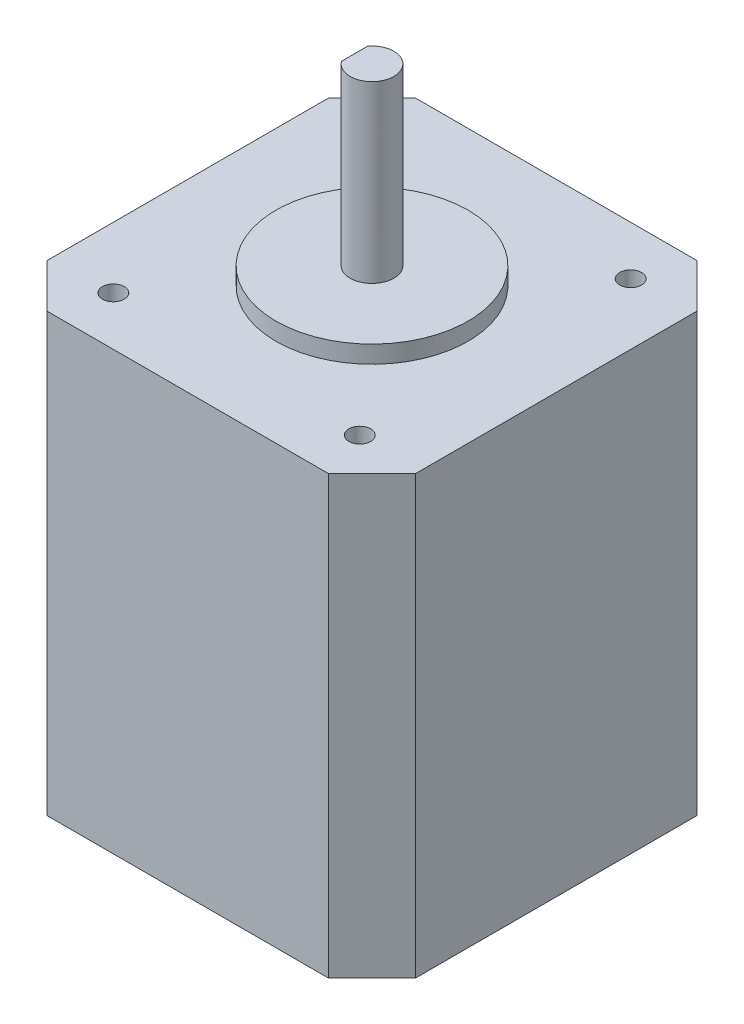
ISO-10303-21;
HEADER;
FILE_DESCRIPTION(('STEP AP214'),'2;1');
FILE_NAME('part.step','',(''),(''),'','','');
FILE_SCHEMA(('AUTOMOTIVE_DESIGN { 1 0 10303 214 1 1 1 1 }'));
ENDSEC;
DATA;
#1=APPLICATION_CONTEXT('core data for automotive mechanical design processes');
#2=APPLICATION_PROTOCOL_DEFINITION('international standard','automotive_design',2000,#1);
#3=PRODUCT_CONTEXT('',#1,'mechanical');
#4=PRODUCT('Part','Part','',(#3));
#5=PRODUCT_RELATED_PRODUCT_CATEGORY('part','',(#4));
#6=PRODUCT_DEFINITION_FORMATION('','',#4);
#7=PRODUCT_DEFINITION_CONTEXT('part definition',#1,'design');
#8=PRODUCT_DEFINITION('design','',#6,#7);
#9=PRODUCT_DEFINITION_SHAPE('','',#8);
#10=(LENGTH_UNIT() NAMED_UNIT(*) SI_UNIT(.MILLI.,.METRE.));
#11=(NAMED_UNIT(*) PLANE_ANGLE_UNIT() SI_UNIT($,.RADIAN.));
#12=(NAMED_UNIT(*) SI_UNIT($,.STERADIAN.) SOLID_ANGLE_UNIT());
#13=UNCERTAINTY_MEASURE_WITH_UNIT(LENGTH_MEASURE(1.E-05),#10,'distance_accuracy_value','');
#14=(GEOMETRIC_REPRESENTATION_CONTEXT(3) GLOBAL_UNCERTAINTY_ASSIGNED_CONTEXT((#13)) GLOBAL_UNIT_ASSIGNED_CONTEXT((#10,
#11,#12)) REPRESENTATION_CONTEXT('',''));
#15=CARTESIAN_POINT('',(0.,0.,0.));
#16=DIRECTION('',(0.,0.,1.));
#17=DIRECTION('',(1.,0.,0.));
#18=AXIS2_PLACEMENT_3D('',#15,#16,#17);
#19=CARTESIAN_POINT('',(0.,50.,-21.1));
#20=DIRECTION('',(0.,0.,-1.));
#21=DIRECTION('',(-1.,0.,0.));
#22=AXIS2_PLACEMENT_3D('',#19,#20,#21);
#23=PLANE('',#22);
#24=DIRECTION('',(-1.,0.,0.));
#25=VECTOR('',#24,1.);
#26=CARTESIAN_POINT('',(0.,9.,-21.1));
#27=LINE('',#26,#25);
#28=CARTESIAN_POINT('',(10.,9.,-21.1));
#29=VERTEX_POINT('',#28);
#30=CARTESIAN_POINT('',(-10.,9.,-21.1));
#31=VERTEX_POINT('',#30);
#32=EDGE_CURVE('E167',#29,#31,#27,.T.);
#33=ORIENTED_EDGE('',*,*,#32,.T.);
#34=DIRECTION('',(0.,-1.,0.));
#35=VECTOR('',#34,1.);
#36=CARTESIAN_POINT('',(-10.,0.,-21.1));
#37=LINE('',#36,#35);
#38=CARTESIAN_POINT('',(-10.,0.,-21.1));
#39=VERTEX_POINT('',#38);
#40=EDGE_CURVE('E54',#31,#39,#37,.T.);
#41=ORIENTED_EDGE('',*,*,#40,.T.);
#42=DIRECTION('',(1.,0.,0.));
#43=VECTOR('',#42,1.);
#44=CARTESIAN_POINT('',(0.,0.,-21.1));
#45=LINE('',#44,#43);
#46=CARTESIAN_POINT('',(-16.1,0.,-21.1));
#47=VERTEX_POINT('',#46);
#48=EDGE_CURVE('E260',#47,#39,#45,.T.);
#49=ORIENTED_EDGE('',*,*,#48,.F.);
#50=DIRECTION('',(0.,-1.,0.));
#51=VECTOR('',#50,1.);
#52=CARTESIAN_POINT('',(-16.1,50.,-21.1));
#53=LINE('',#52,#51);
#54=CARTESIAN_POINT('',(-16.1,50.,-21.1));
#55=VERTEX_POINT('',#54);
#56=EDGE_CURVE('E269',#55,#47,#53,.T.);
#57=ORIENTED_EDGE('',*,*,#56,.F.);
#58=DIRECTION('',(1.,0.,0.));
#59=VECTOR('',#58,1.);
#60=CARTESIAN_POINT('',(0.,50.,-21.1));
#61=LINE('',#60,#59);
#62=CARTESIAN_POINT('',(16.1,50.,-21.1));
#63=VERTEX_POINT('',#62);
#64=EDGE_CURVE('E224',#55,#63,#61,.T.);
#65=ORIENTED_EDGE('',*,*,#64,.T.);
#66=DIRECTION('',(0.,-1.,0.));
#67=VECTOR('',#66,1.);
#68=CARTESIAN_POINT('',(16.1,50.,-21.1));
#69=LINE('',#68,#67);
#70=CARTESIAN_POINT('',(16.1,0.,-21.1));
#71=VERTEX_POINT('',#70);
#72=EDGE_CURVE('E271',#63,#71,#69,.T.);
#73=ORIENTED_EDGE('',*,*,#72,.T.);
#74=CARTESIAN_POINT('',(10.,0.,-21.1));
#75=VERTEX_POINT('',#74);
#76=EDGE_CURVE('E259',#75,#71,#45,.T.);
#77=ORIENTED_EDGE('',*,*,#76,.F.);
#78=DIRECTION('',(0.,-1.,0.));
#79=VECTOR('',#78,1.);
#80=CARTESIAN_POINT('',(10.,0.,-21.1));
#81=LINE('',#80,#79);
#82=EDGE_CURVE('E156',#29,#75,#81,.T.);
#83=ORIENTED_EDGE('',*,*,#82,.F.);
#84=EDGE_LOOP('',(#33,#41,#49,#57,#65,#73,#77,#83));
#85=FACE_BOUND('',#84,.T.);
#86=ADVANCED_FACE('F39',(#85),#23,.T.);
#87=CARTESIAN_POINT('',(-21.1,50.,0.));
#88=DIRECTION('',(1.,0.,0.));
#89=DIRECTION('',(0.,0.,-1.));
#90=AXIS2_PLACEMENT_3D('',#87,#88,#89);
#91=PLANE('',#90);
#92=DIRECTION('',(0.,0.,1.));
#93=VECTOR('',#92,1.);
#94=CARTESIAN_POINT('',(-21.1,0.,0.));
#95=LINE('',#94,#93);
#96=CARTESIAN_POINT('',(-21.1,0.,-16.1));
#97=VERTEX_POINT('',#96);
#98=CARTESIAN_POINT('',(-21.1,0.,16.1));
#99=VERTEX_POINT('',#98);
#100=EDGE_CURVE('E242',#97,#99,#95,.T.);
#101=ORIENTED_EDGE('',*,*,#100,.T.);
#102=DIRECTION('',(0.,-1.,0.));
#103=VECTOR('',#102,1.);
#104=CARTESIAN_POINT('',(-21.1,50.,16.1));
#105=LINE('',#104,#103);
#106=CARTESIAN_POINT('',(-21.1,50.,16.1));
#107=VERTEX_POINT('',#106);
#108=EDGE_CURVE('E11',#107,#99,#105,.T.);
#109=ORIENTED_EDGE('',*,*,#108,.F.);
#110=DIRECTION('',(0.,0.,1.));
#111=VECTOR('',#110,1.);
#112=CARTESIAN_POINT('',(-21.1,50.,0.));
#113=LINE('',#112,#111);
#114=CARTESIAN_POINT('',(-21.1,50.,-16.1));
#115=VERTEX_POINT('',#114);
#116=EDGE_CURVE('E208',#115,#107,#113,.T.);
#117=ORIENTED_EDGE('',*,*,#116,.F.);
#118=DIRECTION('',(0.,-1.,0.));
#119=VECTOR('',#118,1.);
#120=CARTESIAN_POINT('',(-21.1,50.,-16.1));
#121=LINE('',#120,#119);
#122=EDGE_CURVE('E233',#115,#97,#121,.T.);
#123=ORIENTED_EDGE('',*,*,#122,.T.);
#124=EDGE_LOOP('',(#101,#109,#117,#123));
#125=FACE_BOUND('',#124,.T.);
#126=ADVANCED_FACE('F317',(#125),#91,.F.);
#127=CARTESIAN_POINT('',(-18.6,50.,18.6));
#128=DIRECTION('',(0.707106781186548,0.,-0.707106781186548));
#129=DIRECTION('',(-0.707106781186548,0.,-0.707106781186548));
#130=AXIS2_PLACEMENT_3D('',#127,#128,#129);
#131=PLANE('',#130);
#132=DIRECTION('',(0.707106781186548,0.,0.707106781186548));
#133=VECTOR('',#132,1.);
#134=CARTESIAN_POINT('',(-18.6,0.,18.6));
#135=LINE('',#134,#133);
#136=CARTESIAN_POINT('',(-16.1,0.,21.1));
#137=VERTEX_POINT('',#136);
#138=EDGE_CURVE('E245',#99,#137,#135,.T.);
#139=ORIENTED_EDGE('',*,*,#138,.T.);
#140=DIRECTION('',(0.,-1.,0.));
#141=VECTOR('',#140,1.);
#142=CARTESIAN_POINT('',(-16.1,50.,21.1));
#143=LINE('',#142,#141);
#144=CARTESIAN_POINT('',(-16.1,50.,21.1));
#145=VERTEX_POINT('',#144);
#146=EDGE_CURVE('E47',#145,#137,#143,.T.);
#147=ORIENTED_EDGE('',*,*,#146,.F.);
#148=DIRECTION('',(0.707106781186548,0.,0.707106781186548));
#149=VECTOR('',#148,1.);
#150=CARTESIAN_POINT('',(-18.6,50.,18.6));
#151=LINE('',#150,#149);
#152=EDGE_CURVE('E211',#107,#145,#151,.T.);
#153=ORIENTED_EDGE('',*,*,#152,.F.);
#154=ORIENTED_EDGE('',*,*,#108,.T.);
#155=EDGE_LOOP('',(#139,#147,#153,#154));
#156=FACE_BOUND('',#155,.T.);
#157=ADVANCED_FACE('F318',(#156),#131,.F.);
#158=CARTESIAN_POINT('',(0.,50.,21.1));
#159=DIRECTION('',(0.,0.,-1.));
#160=DIRECTION('',(-1.,0.,0.));
#161=AXIS2_PLACEMENT_3D('',#158,#159,#160);
#162=PLANE('',#161);
#163=DIRECTION('',(1.,0.,0.));
#164=VECTOR('',#163,1.);
#165=CARTESIAN_POINT('',(0.,0.,21.1));
#166=LINE('',#165,#164);
#167=CARTESIAN_POINT('',(16.1,0.,21.1));
#168=VERTEX_POINT('',#167);
#169=EDGE_CURVE('E247',#137,#168,#166,.T.);
#170=ORIENTED_EDGE('',*,*,#169,.T.);
#171=DIRECTION('',(0.,-1.,0.));
#172=VECTOR('',#171,1.);
#173=CARTESIAN_POINT('',(16.1,50.,21.1));
#174=LINE('',#173,#172);
#175=CARTESIAN_POINT('',(16.1,50.,21.1));
#176=VERTEX_POINT('',#175);
#177=EDGE_CURVE('E278',#176,#168,#174,.T.);
#178=ORIENTED_EDGE('',*,*,#177,.F.);
#179=DIRECTION('',(1.,0.,0.));
#180=VECTOR('',#179,1.);
#181=CARTESIAN_POINT('',(0.,50.,21.1));
#182=LINE('',#181,#180);
#183=EDGE_CURVE('E213',#145,#176,#182,.T.);
#184=ORIENTED_EDGE('',*,*,#183,.F.);
#185=ORIENTED_EDGE('',*,*,#146,.T.);
#186=EDGE_LOOP('',(#170,#178,#184,#185));
#187=FACE_BOUND('',#186,.T.);
#188=ADVANCED_FACE('F284',(#187),#162,.F.);
#189=CARTESIAN_POINT('',(18.6,50.,18.6));
#190=DIRECTION('',(0.707106781186548,0.,0.707106781186548));
#191=DIRECTION('',(0.707106781186548,0.,-0.707106781186548));
#192=AXIS2_PLACEMENT_3D('',#189,#190,#191);
#193=PLANE('',#192);
#194=DIRECTION('',(-0.707106781186548,0.,0.707106781186548));
#195=VECTOR('',#194,1.);
#196=CARTESIAN_POINT('',(18.6,0.,18.6));
#197=LINE('',#196,#195);
#198=CARTESIAN_POINT('',(21.1,0.,16.1));
#199=VERTEX_POINT('',#198);
#200=EDGE_CURVE('E250',#199,#168,#197,.T.);
#201=ORIENTED_EDGE('',*,*,#200,.F.);
#202=DIRECTION('',(0.,-1.,0.));
#203=VECTOR('',#202,1.);
#204=CARTESIAN_POINT('',(21.1,50.,16.1));
#205=LINE('',#204,#203);
#206=CARTESIAN_POINT('',(21.1,50.,16.1));
#207=VERTEX_POINT('',#206);
#208=EDGE_CURVE('E276',#207,#199,#205,.T.);
#209=ORIENTED_EDGE('',*,*,#208,.F.);
#210=DIRECTION('',(-0.707106781186548,0.,0.707106781186548));
#211=VECTOR('',#210,1.);
#212=CARTESIAN_POINT('',(18.6,50.,18.6));
#213=LINE('',#212,#211);
#214=EDGE_CURVE('E215',#207,#176,#213,.T.);
#215=ORIENTED_EDGE('',*,*,#214,.T.);
#216=ORIENTED_EDGE('',*,*,#177,.T.);
#217=EDGE_LOOP('',(#201,#209,#215,#216));
#218=FACE_BOUND('',#217,.T.);
#219=ADVANCED_FACE('F294',(#218),#193,.T.);
#220=CARTESIAN_POINT('',(21.1,50.,0.));
#221=DIRECTION('',(1.,0.,0.));
#222=DIRECTION('',(0.,0.,-1.));
#223=AXIS2_PLACEMENT_3D('',#220,#221,#222);
#224=PLANE('',#223);
#225=DIRECTION('',(0.,0.,1.));
#226=VECTOR('',#225,1.);
#227=CARTESIAN_POINT('',(21.1,0.,0.));
#228=LINE('',#227,#226);
#229=CARTESIAN_POINT('',(21.1,0.,-16.1));
#230=VERTEX_POINT('',#229);
#231=EDGE_CURVE('E253',#230,#199,#228,.T.);
#232=ORIENTED_EDGE('',*,*,#231,.F.);
#233=DIRECTION('',(0.,-1.,0.));
#234=VECTOR('',#233,1.);
#235=CARTESIAN_POINT('',(21.1,50.,-16.1));
#236=LINE('',#235,#234);
#237=CARTESIAN_POINT('',(21.1,50.,-16.1));
#238=VERTEX_POINT('',#237);
#239=EDGE_CURVE('E274',#238,#230,#236,.T.);
#240=ORIENTED_EDGE('',*,*,#239,.F.);
#241=DIRECTION('',(0.,0.,1.));
#242=VECTOR('',#241,1.);
#243=CARTESIAN_POINT('',(21.1,50.,0.));
#244=LINE('',#243,#242);
#245=EDGE_CURVE('E218',#238,#207,#244,.T.);
#246=ORIENTED_EDGE('',*,*,#245,.T.);
#247=ORIENTED_EDGE('',*,*,#208,.T.);
#248=EDGE_LOOP('',(#232,#240,#246,#247));
#249=FACE_BOUND('',#248,.T.);
#250=ADVANCED_FACE('F302',(#249),#224,.T.);
#251=CARTESIAN_POINT('',(18.6,50.,-18.6));
#252=DIRECTION('',(0.707106781186548,0.,-0.707106781186548));
#253=DIRECTION('',(-0.707106781186548,0.,-0.707106781186548));
#254=AXIS2_PLACEMENT_3D('',#251,#252,#253);
#255=PLANE('',#254);
#256=DIRECTION('',(0.707106781186548,0.,0.707106781186548));
#257=VECTOR('',#256,1.);
#258=CARTESIAN_POINT('',(18.6,0.,-18.6));
#259=LINE('',#258,#257);
#260=EDGE_CURVE('E256',#71,#230,#259,.T.);
#261=ORIENTED_EDGE('',*,*,#260,.F.);
#262=ORIENTED_EDGE('',*,*,#72,.F.);
#263=DIRECTION('',(0.707106781186548,0.,0.707106781186548));
#264=VECTOR('',#263,1.);
#265=CARTESIAN_POINT('',(18.6,50.,-18.6));
#266=LINE('',#265,#264);
#267=EDGE_CURVE('E221',#63,#238,#266,.T.);
#268=ORIENTED_EDGE('',*,*,#267,.T.);
#269=ORIENTED_EDGE('',*,*,#239,.T.);
#270=EDGE_LOOP('',(#261,#262,#268,#269));
#271=FACE_BOUND('',#270,.T.);
#272=ADVANCED_FACE('F305',(#271),#255,.T.);
#273=CARTESIAN_POINT('',(-18.6,50.,-18.6));
#274=DIRECTION('',(-0.707106781186548,0.,-0.707106781186548));
#275=DIRECTION('',(-0.707106781186548,0.,0.707106781186548));
#276=AXIS2_PLACEMENT_3D('',#273,#274,#275);
#277=PLANE('',#276);
#278=DIRECTION('',(0.707106781186548,0.,-0.707106781186548));
#279=VECTOR('',#278,1.);
#280=CARTESIAN_POINT('',(-18.6,0.,-18.6));
#281=LINE('',#280,#279);
#282=EDGE_CURVE('E263',#97,#47,#281,.T.);
#283=ORIENTED_EDGE('',*,*,#282,.F.);
#284=ORIENTED_EDGE('',*,*,#122,.F.);
#285=DIRECTION('',(0.707106781186548,0.,-0.707106781186548));
#286=VECTOR('',#285,1.);
#287=CARTESIAN_POINT('',(-18.6,50.,-18.6));
#288=LINE('',#287,#286);
#289=EDGE_CURVE('E227',#115,#55,#288,.T.);
#290=ORIENTED_EDGE('',*,*,#289,.T.);
#291=ORIENTED_EDGE('',*,*,#56,.T.);
#292=EDGE_LOOP('',(#283,#284,#290,#291));
#293=FACE_BOUND('',#292,.T.);
#294=ADVANCED_FACE('F313',(#293),#277,.T.);
#295=CARTESIAN_POINT('',(-14.1,50.,-15.5));
#296=DIRECTION('',(0.,-1.,0.));
#297=DIRECTION('',(0.,0.,-1.));
#298=AXIS2_PLACEMENT_3D('',#295,#296,#297);
#299=CYLINDRICAL_SURFACE('',#298,1.25);
#300=CARTESIAN_POINT('',(-14.1,50.,-15.5));
#301=DIRECTION('',(0.,1.,0.));
#302=DIRECTION('',(0.,0.,1.));
#303=AXIS2_PLACEMENT_3D('',#300,#301,#302);
#304=CIRCLE('',#303,1.25);
#305=CARTESIAN_POINT('',(-14.1,50.,-14.25));
#306=VERTEX_POINT('',#305);
#307=EDGE_CURVE('E202',#306,#306,#304,.T.);
#308=ORIENTED_EDGE('',*,*,#307,.T.);
#309=EDGE_LOOP('',(#308));
#310=FACE_BOUND('',#309,.T.);
#311=CARTESIAN_POINT('',(-14.1,0.,-15.5));
#312=DIRECTION('',(0.,1.,0.));
#313=DIRECTION('',(0.,0.,1.));
#314=AXIS2_PLACEMENT_3D('',#311,#312,#313);
#315=CIRCLE('',#314,1.25);
#316=CARTESIAN_POINT('',(-14.1,0.,-14.25));
#317=VERTEX_POINT('',#316);
#318=EDGE_CURVE('E239',#317,#317,#315,.T.);
#319=ORIENTED_EDGE('',*,*,#318,.F.);
#320=EDGE_LOOP('',(#319));
#321=FACE_BOUND('',#320,.T.);
#322=ADVANCED_FACE('F357',(#310,#321),#299,.F.);
#323=CARTESIAN_POINT('',(14.1,50.,-15.5));
#324=DIRECTION('',(0.,-1.,0.));
#325=DIRECTION('',(0.,0.,-1.));
#326=AXIS2_PLACEMENT_3D('',#323,#324,#325);
#327=CYLINDRICAL_SURFACE('',#326,1.25);
#328=CARTESIAN_POINT('',(14.1,50.,-15.5));
#329=DIRECTION('',(0.,1.,0.));
#330=DIRECTION('',(0.,0.,1.));
#331=AXIS2_PLACEMENT_3D('',#328,#329,#330);
#332=CIRCLE('',#331,1.25);
#333=CARTESIAN_POINT('',(14.1,50.,-14.25));
#334=VERTEX_POINT('',#333);
#335=EDGE_CURVE('E198',#334,#334,#332,.T.);
#336=ORIENTED_EDGE('',*,*,#335,.T.);
#337=EDGE_LOOP('',(#336));
#338=FACE_BOUND('',#337,.T.);
#339=CARTESIAN_POINT('',(14.1,0.,-15.5));
#340=DIRECTION('',(0.,1.,0.));
#341=DIRECTION('',(0.,0.,1.));
#342=AXIS2_PLACEMENT_3D('',#339,#340,#341);
#343=CIRCLE('',#342,1.25);
#344=CARTESIAN_POINT('',(14.1,0.,-14.25));
#345=VERTEX_POINT('',#344);
#346=EDGE_CURVE('E236',#345,#345,#343,.T.);
#347=ORIENTED_EDGE('',*,*,#346,.F.);
#348=EDGE_LOOP('',(#347));
#349=FACE_BOUND('',#348,.T.);
#350=ADVANCED_FACE('F363',(#338,#349),#327,.F.);
#351=CARTESIAN_POINT('',(14.1,50.,15.5));
#352=DIRECTION('',(0.,-1.,0.));
#353=DIRECTION('',(0.,0.,-1.));
#354=AXIS2_PLACEMENT_3D('',#351,#352,#353);
#355=CYLINDRICAL_SURFACE('',#354,1.25);
#356=CARTESIAN_POINT('',(14.1,50.,15.5));
#357=DIRECTION('',(0.,1.,0.));
#358=DIRECTION('',(0.,0.,1.));
#359=AXIS2_PLACEMENT_3D('',#356,#357,#358);
#360=CIRCLE('',#359,1.25);
#361=CARTESIAN_POINT('',(14.1,50.,16.75));
#362=VERTEX_POINT('',#361);
#363=EDGE_CURVE('E195',#362,#362,#360,.F.);
#364=ORIENTED_EDGE('',*,*,#363,.F.);
#365=EDGE_LOOP('',(#364));
#366=FACE_BOUND('',#365,.T.);
#367=CARTESIAN_POINT('',(14.1,0.,15.5));
#368=DIRECTION('',(0.,1.,0.));
#369=DIRECTION('',(0.,0.,1.));
#370=AXIS2_PLACEMENT_3D('',#367,#368,#369);
#371=CIRCLE('',#370,1.25);
#372=CARTESIAN_POINT('',(14.1,0.,16.75));
#373=VERTEX_POINT('',#372);
#374=EDGE_CURVE('E194',#373,#373,#371,.F.);
#375=ORIENTED_EDGE('',*,*,#374,.T.);
#376=EDGE_LOOP('',(#375));
#377=FACE_BOUND('',#376,.T.);
#378=ADVANCED_FACE('F41',(#366,#377),#355,.F.);
#379=CARTESIAN_POINT('',(-14.1,50.,15.5));
#380=DIRECTION('',(0.,-1.,0.));
#381=DIRECTION('',(0.,0.,-1.));
#382=AXIS2_PLACEMENT_3D('',#379,#380,#381);
#383=CYLINDRICAL_SURFACE('',#382,1.25);
#384=CARTESIAN_POINT('',(-14.1,50.,15.5));
#385=DIRECTION('',(0.,1.,0.));
#386=DIRECTION('',(0.,0.,1.));
#387=AXIS2_PLACEMENT_3D('',#384,#385,#386);
#388=CIRCLE('',#387,1.25);
#389=CARTESIAN_POINT('',(-14.1,50.,16.75));
#390=VERTEX_POINT('',#389);
#391=EDGE_CURVE('E230',#390,#390,#388,.F.);
#392=ORIENTED_EDGE('',*,*,#391,.F.);
#393=EDGE_LOOP('',(#392));
#394=FACE_BOUND('',#393,.T.);
#395=CARTESIAN_POINT('',(-14.1,0.,15.5));
#396=DIRECTION('',(0.,1.,0.));
#397=DIRECTION('',(0.,0.,1.));
#398=AXIS2_PLACEMENT_3D('',#395,#396,#397);
#399=CIRCLE('',#398,1.25);
#400=CARTESIAN_POINT('',(-14.1,0.,16.75));
#401=VERTEX_POINT('',#400);
#402=EDGE_CURVE('E199',#401,#401,#399,.F.);
#403=ORIENTED_EDGE('',*,*,#402,.T.);
#404=EDGE_LOOP('',(#403));
#405=FACE_BOUND('',#404,.T.);
#406=ADVANCED_FACE('F377',(#394,#405),#383,.F.);
#407=CARTESIAN_POINT('',(0.,50.,0.));
#408=DIRECTION('',(0.,1.,0.));
#409=DIRECTION('',(0.,0.,1.));
#410=AXIS2_PLACEMENT_3D('',#407,#408,#409);
#411=PLANE('',#410);
#412=ORIENTED_EDGE('',*,*,#363,.T.);
#413=EDGE_LOOP('',(#412));
#414=FACE_BOUND('',#413,.T.);
#415=ORIENTED_EDGE('',*,*,#335,.F.);
#416=EDGE_LOOP('',(#415));
#417=FACE_BOUND('',#416,.T.);
#418=ORIENTED_EDGE('',*,*,#307,.F.);
#419=EDGE_LOOP('',(#418));
#420=FACE_BOUND('',#419,.T.);
#421=CARTESIAN_POINT('',(0.,50.,0.));
#422=DIRECTION('',(0.,1.,0.));
#423=DIRECTION('',(0.,0.,1.));
#424=AXIS2_PLACEMENT_3D('',#421,#422,#423);
#425=CIRCLE('',#424,11.);
#426=CARTESIAN_POINT('',(0.,50.,11.));
#427=VERTEX_POINT('',#426);
#428=EDGE_CURVE('E205',#427,#427,#425,.T.);
#429=ORIENTED_EDGE('',*,*,#428,.F.);
#430=EDGE_LOOP('',(#429));
#431=FACE_BOUND('',#430,.T.);
#432=ORIENTED_EDGE('',*,*,#116,.T.);
#433=ORIENTED_EDGE('',*,*,#152,.T.);
#434=ORIENTED_EDGE('',*,*,#183,.T.);
#435=ORIENTED_EDGE('',*,*,#214,.F.);
#436=ORIENTED_EDGE('',*,*,#245,.F.);
#437=ORIENTED_EDGE('',*,*,#267,.F.);
#438=ORIENTED_EDGE('',*,*,#64,.F.);
#439=ORIENTED_EDGE('',*,*,#289,.F.);
#440=EDGE_LOOP('',(#432,#433,#434,#435,#436,#437,#438,#439));
#441=FACE_BOUND('',#440,.T.);
#442=ORIENTED_EDGE('',*,*,#391,.T.);
#443=EDGE_LOOP('',(#442));
#444=FACE_BOUND('',#443,.T.);
#445=ADVANCED_FACE('F298',(#414,#417,#420,#431,#441,#444),#411,.T.);
#446=CARTESIAN_POINT('',(0.,0.,0.));
#447=DIRECTION('',(0.,1.,0.));
#448=DIRECTION('',(0.,0.,1.));
#449=AXIS2_PLACEMENT_3D('',#446,#447,#448);
#450=PLANE('',#449);
#451=ORIENTED_EDGE('',*,*,#374,.F.);
#452=EDGE_LOOP('',(#451));
#453=FACE_BOUND('',#452,.T.);
#454=ORIENTED_EDGE('',*,*,#346,.T.);
#455=EDGE_LOOP('',(#454));
#456=FACE_BOUND('',#455,.T.);
#457=ORIENTED_EDGE('',*,*,#318,.T.);
#458=EDGE_LOOP('',(#457));
#459=FACE_BOUND('',#458,.T.);
#460=ORIENTED_EDGE('',*,*,#100,.F.);
#461=ORIENTED_EDGE('',*,*,#282,.T.);
#462=ORIENTED_EDGE('',*,*,#48,.T.);
#463=DIRECTION('',(0.,0.,1.));
#464=VECTOR('',#463,1.);
#465=CARTESIAN_POINT('',(-10.,0.,-27.1));
#466=LINE('',#465,#464);
#467=CARTESIAN_POINT('',(-10.,0.,-27.1));
#468=VERTEX_POINT('',#467);
#469=EDGE_CURVE('E165',#468,#39,#466,.T.);
#470=ORIENTED_EDGE('',*,*,#469,.F.);
#471=DIRECTION('',(-1.,0.,0.));
#472=VECTOR('',#471,1.);
#473=CARTESIAN_POINT('',(0.,0.,-27.1));
#474=LINE('',#473,#472);
#475=CARTESIAN_POINT('',(10.,0.,-27.1));
#476=VERTEX_POINT('',#475);
#477=EDGE_CURVE('E154',#476,#468,#474,.T.);
#478=ORIENTED_EDGE('',*,*,#477,.F.);
#479=DIRECTION('',(0.,0.,1.));
#480=VECTOR('',#479,1.);
#481=CARTESIAN_POINT('',(10.,0.,-27.1));
#482=LINE('',#481,#480);
#483=EDGE_CURVE('E171',#476,#75,#482,.T.);
#484=ORIENTED_EDGE('',*,*,#483,.T.);
#485=ORIENTED_EDGE('',*,*,#76,.T.);
#486=ORIENTED_EDGE('',*,*,#260,.T.);
#487=ORIENTED_EDGE('',*,*,#231,.T.);
#488=ORIENTED_EDGE('',*,*,#200,.T.);
#489=ORIENTED_EDGE('',*,*,#169,.F.);
#490=ORIENTED_EDGE('',*,*,#138,.F.);
#491=EDGE_LOOP('',(#460,#461,#462,#470,#478,#484,#485,#486,#487,#488,#489,#490));
#492=FACE_BOUND('',#491,.T.);
#493=ORIENTED_EDGE('',*,*,#402,.F.);
#494=EDGE_LOOP('',(#493));
#495=FACE_BOUND('',#494,.T.);
#496=ADVANCED_FACE('F289',(#453,#456,#459,#492,#495),#450,.F.);
#497=CARTESIAN_POINT('',(0.,52.,0.));
#498=DIRECTION('',(0.,-1.,0.));
#499=DIRECTION('',(0.,0.,-1.));
#500=AXIS2_PLACEMENT_3D('',#497,#498,#499);
#501=CYLINDRICAL_SURFACE('',#500,11.);
#502=ORIENTED_EDGE('',*,*,#428,.T.);
#503=EDGE_LOOP('',(#502));
#504=FACE_BOUND('',#503,.T.);
#505=CARTESIAN_POINT('',(0.,52.,0.));
#506=DIRECTION('',(0.,1.,0.));
#507=DIRECTION('',(0.,0.,1.));
#508=AXIS2_PLACEMENT_3D('',#505,#506,#507);
#509=CIRCLE('',#508,11.);
#510=CARTESIAN_POINT('',(0.,52.,11.));
#511=VERTEX_POINT('',#510);
#512=EDGE_CURVE('E191',#511,#511,#509,.T.);
#513=ORIENTED_EDGE('',*,*,#512,.F.);
#514=EDGE_LOOP('',(#513));
#515=FACE_BOUND('',#514,.T.);
#516=ADVANCED_FACE('F398',(#504,#515),#501,.T.);
#517=CARTESIAN_POINT('',(0.,52.,0.));
#518=DIRECTION('',(0.,1.,0.));
#519=DIRECTION('',(0.,0.,1.));
#520=AXIS2_PLACEMENT_3D('',#517,#518,#519);
#521=PLANE('',#520);
#522=CARTESIAN_POINT('',(0.,52.,0.));
#523=DIRECTION('',(0.,1.,0.));
#524=DIRECTION('',(0.,0.,1.));
#525=AXIS2_PLACEMENT_3D('',#522,#523,#524);
#526=CIRCLE('',#525,2.5);
#527=CARTESIAN_POINT('',(0.,52.,2.5));
#528=VERTEX_POINT('',#527);
#529=EDGE_CURVE('E188',#528,#528,#526,.T.);
#530=ORIENTED_EDGE('',*,*,#529,.F.);
#531=EDGE_LOOP('',(#530));
#532=FACE_BOUND('',#531,.T.);
#533=ORIENTED_EDGE('',*,*,#512,.T.);
#534=EDGE_LOOP('',(#533));
#535=FACE_BOUND('',#534,.T.);
#536=ADVANCED_FACE('F406',(#532,#535),#521,.T.);
#537=CARTESIAN_POINT('',(-2.,72.,0.));
#538=DIRECTION('',(1.,0.,0.));
#539=DIRECTION('',(0.,0.,-1.));
#540=AXIS2_PLACEMENT_3D('',#537,#538,#539);
#541=PLANE('',#540);
#542=DIRECTION('',(0.,-1.,0.));
#543=VECTOR('',#542,1.);
#544=CARTESIAN_POINT('',(-2.,72.,-1.5));
#545=LINE('',#544,#543);
#546=CARTESIAN_POINT('',(-2.,72.,-1.5));
#547=VERTEX_POINT('',#546);
#548=CARTESIAN_POINT('',(-2.,57.,-1.5));
#549=VERTEX_POINT('',#548);
#550=EDGE_CURVE('E184',#547,#549,#545,.T.);
#551=ORIENTED_EDGE('',*,*,#550,.T.);
#552=DIRECTION('',(0.,0.,1.));
#553=VECTOR('',#552,1.);
#554=CARTESIAN_POINT('',(-2.,57.,0.));
#555=LINE('',#554,#553);
#556=CARTESIAN_POINT('',(-2.,57.,1.5));
#557=VERTEX_POINT('',#556);
#558=EDGE_CURVE('E62',#549,#557,#555,.T.);
#559=ORIENTED_EDGE('',*,*,#558,.T.);
#560=DIRECTION('',(0.,-1.,0.));
#561=VECTOR('',#560,1.);
#562=CARTESIAN_POINT('',(-2.,72.,1.5));
#563=LINE('',#562,#561);
#564=CARTESIAN_POINT('',(-2.,72.,1.5));
#565=VERTEX_POINT('',#564);
#566=EDGE_CURVE('E186',#565,#557,#563,.T.);
#567=ORIENTED_EDGE('',*,*,#566,.F.);
#568=DIRECTION('',(0.,0.,1.));
#569=VECTOR('',#568,1.);
#570=CARTESIAN_POINT('',(-2.,72.,0.));
#571=LINE('',#570,#569);
#572=EDGE_CURVE('E179',#547,#565,#571,.T.);
#573=ORIENTED_EDGE('',*,*,#572,.F.);
#574=EDGE_LOOP('',(#551,#559,#567,#573));
#575=FACE_BOUND('',#574,.T.);
#576=ADVANCED_FACE('F415',(#575),#541,.F.);
#577=CARTESIAN_POINT('',(0.,72.,0.));
#578=DIRECTION('',(0.,-1.,0.));
#579=DIRECTION('',(0.,0.,-1.));
#580=AXIS2_PLACEMENT_3D('',#577,#578,#579);
#581=CYLINDRICAL_SURFACE('',#580,2.5);
#582=ORIENTED_EDGE('',*,*,#529,.T.);
#583=EDGE_LOOP('',(#582));
#584=FACE_BOUND('',#583,.T.);
#585=ORIENTED_EDGE('',*,*,#566,.T.);
#586=CARTESIAN_POINT('',(0.,57.,0.));
#587=DIRECTION('',(0.,1.,0.));
#588=DIRECTION('',(0.,0.,1.));
#589=AXIS2_PLACEMENT_3D('',#586,#587,#588);
#590=CIRCLE('',#589,2.5);
#591=EDGE_CURVE('E176',#549,#557,#590,.T.);
#592=ORIENTED_EDGE('',*,*,#591,.F.);
#593=ORIENTED_EDGE('',*,*,#550,.F.);
#594=CARTESIAN_POINT('',(0.,72.,0.));
#595=DIRECTION('',(0.,1.,0.));
#596=DIRECTION('',(0.,0.,1.));
#597=AXIS2_PLACEMENT_3D('',#594,#595,#596);
#598=CIRCLE('',#597,2.5);
#599=EDGE_CURVE('E182',#565,#547,#598,.T.);
#600=ORIENTED_EDGE('',*,*,#599,.F.);
#601=EDGE_LOOP('',(#585,#592,#593,#600));
#602=FACE_BOUND('',#601,.T.);
#603=ADVANCED_FACE('F423',(#584,#602),#581,.T.);
#604=CARTESIAN_POINT('',(0.,72.,0.));
#605=DIRECTION('',(0.,1.,0.));
#606=DIRECTION('',(0.,0.,1.));
#607=AXIS2_PLACEMENT_3D('',#604,#605,#606);
#608=PLANE('',#607);
#609=ORIENTED_EDGE('',*,*,#572,.T.);
#610=ORIENTED_EDGE('',*,*,#599,.T.);
#611=EDGE_LOOP('',(#609,#610));
#612=FACE_BOUND('',#611,.T.);
#613=ADVANCED_FACE('F430',(#612),#608,.T.);
#614=CARTESIAN_POINT('',(0.,57.,0.));
#615=DIRECTION('',(0.,1.,0.));
#616=DIRECTION('',(0.,0.,1.));
#617=AXIS2_PLACEMENT_3D('',#614,#615,#616);
#618=PLANE('',#617);
#619=ORIENTED_EDGE('',*,*,#558,.F.);
#620=ORIENTED_EDGE('',*,*,#591,.T.);
#621=EDGE_LOOP('',(#619,#620));
#622=FACE_BOUND('',#621,.T.);
#623=ADVANCED_FACE('F438',(#622),#618,.T.);
#624=CARTESIAN_POINT('',(-10.,0.,-27.1));
#625=DIRECTION('',(-1.,0.,0.));
#626=DIRECTION('',(0.,0.,1.));
#627=AXIS2_PLACEMENT_3D('',#624,#625,#626);
#628=PLANE('',#627);
#629=ORIENTED_EDGE('',*,*,#40,.F.);
#630=DIRECTION('',(0.,0.,1.));
#631=VECTOR('',#630,1.);
#632=CARTESIAN_POINT('',(-10.,9.,-27.1));
#633=LINE('',#632,#631);
#634=CARTESIAN_POINT('',(-10.,9.,-27.1));
#635=VERTEX_POINT('',#634);
#636=EDGE_CURVE('E139',#635,#31,#633,.T.);
#637=ORIENTED_EDGE('',*,*,#636,.F.);
#638=DIRECTION('',(0.,-1.,0.));
#639=VECTOR('',#638,1.);
#640=CARTESIAN_POINT('',(-10.,0.,-27.1));
#641=LINE('',#640,#639);
#642=EDGE_CURVE('E142',#635,#468,#641,.T.);
#643=ORIENTED_EDGE('',*,*,#642,.T.);
#644=ORIENTED_EDGE('',*,*,#469,.T.);
#645=EDGE_LOOP('',(#629,#637,#643,#644));
#646=FACE_BOUND('',#645,.T.);
#647=ADVANCED_FACE('F141',(#646),#628,.T.);
#648=CARTESIAN_POINT('',(0.,9.,-27.1));
#649=DIRECTION('',(0.,1.,0.));
#650=DIRECTION('',(0.,0.,1.));
#651=AXIS2_PLACEMENT_3D('',#648,#649,#650);
#652=PLANE('',#651);
#653=ORIENTED_EDGE('',*,*,#32,.F.);
#654=DIRECTION('',(0.,0.,1.));
#655=VECTOR('',#654,1.);
#656=CARTESIAN_POINT('',(10.,9.,-27.1));
#657=LINE('',#656,#655);
#658=CARTESIAN_POINT('',(10.,9.,-27.1));
#659=VERTEX_POINT('',#658);
#660=EDGE_CURVE('E147',#659,#29,#657,.T.);
#661=ORIENTED_EDGE('',*,*,#660,.F.);
#662=DIRECTION('',(-1.,0.,0.));
#663=VECTOR('',#662,1.);
#664=CARTESIAN_POINT('',(0.,9.,-27.1));
#665=LINE('',#664,#663);
#666=EDGE_CURVE('E152',#659,#635,#665,.T.);
#667=ORIENTED_EDGE('',*,*,#666,.T.);
#668=ORIENTED_EDGE('',*,*,#636,.T.);
#669=EDGE_LOOP('',(#653,#661,#667,#668));
#670=FACE_BOUND('',#669,.T.);
#671=ADVANCED_FACE('F158',(#670),#652,.T.);
#672=CARTESIAN_POINT('',(10.,0.,-27.1));
#673=DIRECTION('',(-1.,0.,0.));
#674=DIRECTION('',(0.,0.,1.));
#675=AXIS2_PLACEMENT_3D('',#672,#673,#674);
#676=PLANE('',#675);
#677=ORIENTED_EDGE('',*,*,#82,.T.);
#678=ORIENTED_EDGE('',*,*,#483,.F.);
#679=DIRECTION('',(0.,-1.,0.));
#680=VECTOR('',#679,1.);
#681=CARTESIAN_POINT('',(10.,0.,-27.1));
#682=LINE('',#681,#680);
#683=EDGE_CURVE('E160',#659,#476,#682,.T.);
#684=ORIENTED_EDGE('',*,*,#683,.F.);
#685=ORIENTED_EDGE('',*,*,#660,.T.);
#686=EDGE_LOOP('',(#677,#678,#684,#685));
#687=FACE_BOUND('',#686,.T.);
#688=ADVANCED_FACE('F457',(#687),#676,.F.);
#689=CARTESIAN_POINT('',(0.,0.,-27.1));
#690=DIRECTION('',(0.,0.,-1.));
#691=DIRECTION('',(-1.,0.,0.));
#692=AXIS2_PLACEMENT_3D('',#689,#690,#691);
#693=PLANE('',#692);
#694=ORIENTED_EDGE('',*,*,#642,.F.);
#695=ORIENTED_EDGE('',*,*,#666,.F.);
#696=ORIENTED_EDGE('',*,*,#683,.T.);
#697=ORIENTED_EDGE('',*,*,#477,.T.);
#698=EDGE_LOOP('',(#694,#695,#696,#697));
#699=FACE_BOUND('',#698,.T.);
#700=ADVANCED_FACE('F151',(#699),#693,.T.);
#701=CLOSED_SHELL('',(#86,#126,#157,#188,#219,#250,#272,#294,#322,#350,#378,#406,#445,#496,#516,
#536,#576,#603,#613,#623,#647,#671,#688,#700));
#702=MANIFOLD_SOLID_BREP('B2',#701);
#703=ADVANCED_BREP_SHAPE_REPRESENTATION('',(#18,#702),#14);
#704=SHAPE_DEFINITION_REPRESENTATION(#9,#703);
ENDSEC;
END-ISO-10303-21;
